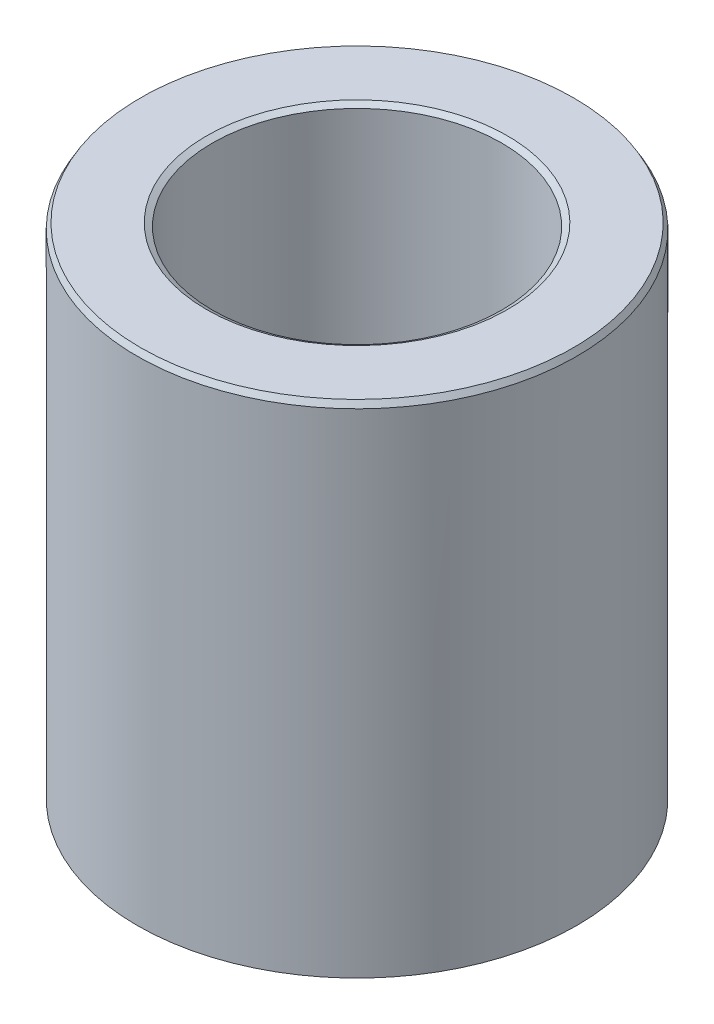
ISO-10303-21;
HEADER;
FILE_DESCRIPTION(('STEP AP214'),'2;1');
FILE_NAME('part.step','',(''),(''),'','','');
FILE_SCHEMA(('AUTOMOTIVE_DESIGN { 1 0 10303 214 1 1 1 1 }'));
ENDSEC;
DATA;
#1=APPLICATION_CONTEXT('core data for automotive mechanical design processes');
#2=APPLICATION_PROTOCOL_DEFINITION('international standard','automotive_design',2000,#1);
#3=PRODUCT_CONTEXT('',#1,'mechanical');
#4=PRODUCT('Part','Part','',(#3));
#5=PRODUCT_RELATED_PRODUCT_CATEGORY('part','',(#4));
#6=PRODUCT_DEFINITION_FORMATION('','',#4);
#7=PRODUCT_DEFINITION_CONTEXT('part definition',#1,'design');
#8=PRODUCT_DEFINITION('design','',#6,#7);
#9=PRODUCT_DEFINITION_SHAPE('','',#8);
#10=(LENGTH_UNIT() NAMED_UNIT(*) SI_UNIT(.MILLI.,.METRE.));
#11=(NAMED_UNIT(*) PLANE_ANGLE_UNIT() SI_UNIT($,.RADIAN.));
#12=(NAMED_UNIT(*) SI_UNIT($,.STERADIAN.) SOLID_ANGLE_UNIT());
#13=UNCERTAINTY_MEASURE_WITH_UNIT(LENGTH_MEASURE(1.E-05),#10,'distance_accuracy_value','');
#14=(GEOMETRIC_REPRESENTATION_CONTEXT(3) GLOBAL_UNCERTAINTY_ASSIGNED_CONTEXT((#13)) GLOBAL_UNIT_ASSIGNED_CONTEXT((#10,
#11,#12)) REPRESENTATION_CONTEXT('',''));
#15=CARTESIAN_POINT('',(0.,0.,0.));
#16=DIRECTION('',(0.,0.,1.));
#17=DIRECTION('',(1.,0.,0.));
#18=AXIS2_PLACEMENT_3D('',#15,#16,#17);
#19=CARTESIAN_POINT('',(0.,102.806656635205,0.));
#20=DIRECTION('',(0.,-1.,0.));
#21=DIRECTION('',(0.,0.,-1.));
#22=AXIS2_PLACEMENT_3D('',#19,#20,#21);
#23=CYLINDRICAL_SURFACE('',#22,45.);
#24=CARTESIAN_POINT('',(0.,0.683298682433511,0.));
#25=DIRECTION('',(0.,1.,0.));
#26=DIRECTION('',(0.,0.,1.));
#27=AXIS2_PLACEMENT_3D('',#24,#25,#26);
#28=CIRCLE('',#27,45.);
#29=CARTESIAN_POINT('',(0.,0.683298682433511,-45.));
#30=VERTEX_POINT('',#29);
#31=EDGE_CURVE('E10',#30,#30,#28,.T.);
#32=CARTESIAN_POINT('',(0.,101.623148600485,0.));
#33=DIRECTION('',(0.,1.,0.));
#34=DIRECTION('',(0.,0.,1.));
#35=AXIS2_PLACEMENT_3D('',#32,#33,#34);
#36=CIRCLE('',#35,45.);
#37=CARTESIAN_POINT('',(0.,101.623148600485,-45.));
#38=VERTEX_POINT('',#37);
#39=EDGE_CURVE('E50',#38,#38,#36,.F.);
#40=CARTESIAN_POINT('',(0.,0.683298682433511,-45.));
#41=CARTESIAN_POINT('',(0.,1.73475545241322,-45.));
#42=CARTESIAN_POINT('',(0.,2.78621222239292,-45.));
#43=CARTESIAN_POINT('',(0.,4.88912576235234,-45.));
#44=CARTESIAN_POINT('',(0.,5.94058253233204,-45.));
#45=CARTESIAN_POINT('',(0.,8.04349607229146,-45.));
#46=CARTESIAN_POINT('',(0.,9.09495284227116,-45.));
#47=CARTESIAN_POINT('',(0.,11.1978663822306,-45.));
#48=CARTESIAN_POINT('',(0.,12.2493231522103,-45.));
#49=CARTESIAN_POINT('',(0.,14.3522366921697,-45.));
#50=CARTESIAN_POINT('',(0.,15.4036934621494,-45.));
#51=CARTESIAN_POINT('',(0.,17.5066070021088,-45.));
#52=CARTESIAN_POINT('',(0.,18.5580637720885,-45.));
#53=CARTESIAN_POINT('',(0.,20.6609773120479,-45.));
#54=CARTESIAN_POINT('',(0.,21.7124340820276,-45.));
#55=CARTESIAN_POINT('',(0.,23.815347621987,-45.));
#56=CARTESIAN_POINT('',(0.,24.8668043919667,-45.));
#57=CARTESIAN_POINT('',(0.,26.9697179319262,-45.));
#58=CARTESIAN_POINT('',(0.,28.0211747019059,-45.));
#59=CARTESIAN_POINT('',(0.,30.1240882418653,-45.));
#60=CARTESIAN_POINT('',(0.,31.175545011845,-45.));
#61=CARTESIAN_POINT('',(0.,33.2784585518044,-45.));
#62=CARTESIAN_POINT('',(0.,34.3299153217841,-45.));
#63=CARTESIAN_POINT('',(0.,36.4328288617435,-45.));
#64=CARTESIAN_POINT('',(0.,37.4842856317232,-45.));
#65=CARTESIAN_POINT('',(0.,39.5871991716826,-45.));
#66=CARTESIAN_POINT('',(0.,40.6386559416623,-45.));
#67=CARTESIAN_POINT('',(0.,42.7415694816218,-45.));
#68=CARTESIAN_POINT('',(0.,43.7930262516015,-45.));
#69=CARTESIAN_POINT('',(0.,45.8959397915609,-45.));
#70=CARTESIAN_POINT('',(0.,46.9473965615406,-45.));
#71=CARTESIAN_POINT('',(0.,49.0503101015,-45.));
#72=CARTESIAN_POINT('',(0.,50.1017668714797,-45.));
#73=CARTESIAN_POINT('',(0.,52.2046804114391,-45.));
#74=CARTESIAN_POINT('',(0.,53.2561371814188,-45.));
#75=CARTESIAN_POINT('',(0.,55.3590507213782,-45.));
#76=CARTESIAN_POINT('',(0.,56.4105074913579,-45.));
#77=CARTESIAN_POINT('',(0.,58.5134210313173,-45.));
#78=CARTESIAN_POINT('',(0.,59.564877801297,-45.));
#79=CARTESIAN_POINT('',(0.,61.6677913412565,-45.));
#80=CARTESIAN_POINT('',(0.,62.7192481112362,-45.));
#81=CARTESIAN_POINT('',(0.,64.8221616511956,-45.));
#82=CARTESIAN_POINT('',(0.,65.8736184211753,-45.));
#83=CARTESIAN_POINT('',(0.,67.9765319611347,-45.));
#84=CARTESIAN_POINT('',(0.,69.0279887311144,-45.));
#85=CARTESIAN_POINT('',(0.,71.1309022710738,-45.));
#86=CARTESIAN_POINT('',(0.,72.1823590410535,-45.));
#87=CARTESIAN_POINT('',(0.,74.2852725810129,-45.));
#88=CARTESIAN_POINT('',(0.,75.3367293509926,-45.));
#89=CARTESIAN_POINT('',(0.,77.4396428909521,-45.));
#90=CARTESIAN_POINT('',(0.,78.4910996609318,-45.));
#91=CARTESIAN_POINT('',(0.,80.5940132008912,-45.));
#92=CARTESIAN_POINT('',(0.,81.6454699708709,-45.));
#93=CARTESIAN_POINT('',(0.,83.7483835108303,-45.));
#94=CARTESIAN_POINT('',(0.,84.79984028081,-45.));
#95=CARTESIAN_POINT('',(0.,86.9027538207694,-45.));
#96=CARTESIAN_POINT('',(0.,87.9542105907491,-45.));
#97=CARTESIAN_POINT('',(0.,90.0571241307085,-45.));
#98=CARTESIAN_POINT('',(0.,91.1085809006882,-45.));
#99=CARTESIAN_POINT('',(0.,93.2114944406476,-45.));
#100=CARTESIAN_POINT('',(0.,94.2629512106273,-45.));
#101=CARTESIAN_POINT('',(0.,96.3658647505868,-45.));
#102=CARTESIAN_POINT('',(0.,97.4173215205664,-45.));
#103=CARTESIAN_POINT('',(0.,99.5202350605259,-45.));
#104=CARTESIAN_POINT('',(0.,100.571691830506,-45.));
#105=CARTESIAN_POINT('',(0.,101.623148600485,-45.));
#106=B_SPLINE_CURVE_WITH_KNOTS('',3,(#40,#41,#42,#43,#44,#45,#46,#47,#48,#49,#50,#51,#52,#53,
#54,#55,#56,#57,#58,#59,#60,#61,#62,#63,#64,#65,#66,#67,#68,#69,#70,#71,#72,#73,#74,#75,#76,#77,
#78,#79,#80,#81,#82,#83,#84,#85,#86,#87,#88,#89,#90,#91,#92,#93,#94,#95,#96,#97,#98,#99,#100,
#101,#102,#103,#104,#105),.UNSPECIFIED.,.F.,.F.,(4,2,2,2,2,2,2,2,2,2,2,2,2,2,2,2,2,2,2,2,2,2,2,
2,2,2,2,2,2,2,2,2,4),(0.,3.15437030993912,6.30874061987824,9.46311092981736,12.6174812397565,
15.7718515496956,18.9262218596347,22.0805921695738,25.2349624795129,28.3893327894521,
31.5437030993912,34.6980734093303,37.8524437192694,41.0068140292085,44.1611843391476,
47.3155546490868,50.4699249590259,53.624295268965,56.7786655789041,59.9330358888432,
63.0874061987824,66.2417765087215,69.3961468186606,72.5505171285997,75.7048874385388,
78.8592577484779,82.0136280584171,85.1679983683562,88.3223686782953,91.4767389882344,
94.6311092981735,97.7854796081127,100.939849918052),.UNSPECIFIED.);
#107=EDGE_CURVE('BSEAM39',#30,#38,#106,.T.);
#108=ORIENTED_EDGE('',*,*,#31,.T.);
#109=ORIENTED_EDGE('',*,*,#39,.T.);
#110=ORIENTED_EDGE('',*,*,#107,.T.);
#111=ORIENTED_EDGE('',*,*,#107,.F.);
#112=EDGE_LOOP('',(#108,#110,#109,#111));
#113=FACE_BOUND('',#112,.T.);
#114=ADVANCED_FACE('F39',(#113),#23,.T.);
#115=CARTESIAN_POINT('',(0.,102.806656635205,0.));
#116=DIRECTION('',(0.,1.,0.));
#117=DIRECTION('',(0.,0.,1.));
#118=AXIS2_PLACEMENT_3D('',#115,#116,#117);
#119=PLANE('',#118);
#120=CARTESIAN_POINT('',(0.,102.806656635205,0.));
#121=DIRECTION('',(0.,1.,0.));
#122=DIRECTION('',(0.,0.,1.));
#123=AXIS2_PLACEMENT_3D('',#120,#121,#122);
#124=CIRCLE('',#123,30.8120299298854);
#125=CARTESIAN_POINT('',(0.,102.806656635205,30.8120299298854));
#126=VERTEX_POINT('',#125);
#127=EDGE_CURVE('E58',#126,#126,#124,.F.);
#128=ORIENTED_EDGE('',*,*,#127,.T.);
#129=EDGE_LOOP('',(#128));
#130=FACE_BOUND('',#129,.T.);
#131=CARTESIAN_POINT('',(0.,102.806656635205,0.));
#132=DIRECTION('',(0.,1.,0.));
#133=DIRECTION('',(0.,0.,1.));
#134=AXIS2_PLACEMENT_3D('',#131,#132,#133);
#135=CIRCLE('',#134,44.3167013175666);
#136=CARTESIAN_POINT('',(0.,102.806656635205,-44.3167013175666));
#137=VERTEX_POINT('',#136);
#138=EDGE_CURVE('E61',#137,#137,#135,.T.);
#139=ORIENTED_EDGE('',*,*,#138,.T.);
#140=EDGE_LOOP('',(#139));
#141=FACE_BOUND('',#140,.T.);
#142=ADVANCED_FACE('F88',(#130,#141),#119,.T.);
#143=CARTESIAN_POINT('',(0.,0.,0.));
#144=DIRECTION('',(0.,1.,0.));
#145=DIRECTION('',(0.,0.,1.));
#146=AXIS2_PLACEMENT_3D('',#143,#144,#145);
#147=PLANE('',#146);
#148=CARTESIAN_POINT('',(0.,0.,0.));
#149=DIRECTION('',(0.,1.,0.));
#150=DIRECTION('',(0.,0.,1.));
#151=AXIS2_PLACEMENT_3D('',#148,#149,#150);
#152=CIRCLE('',#151,30.3118205775991);
#153=CARTESIAN_POINT('',(0.,0.,30.3118205775991));
#154=VERTEX_POINT('',#153);
#155=EDGE_CURVE('E51',#154,#154,#152,.T.);
#156=ORIENTED_EDGE('',*,*,#155,.T.);
#157=EDGE_LOOP('',(#156));
#158=FACE_BOUND('',#157,.T.);
#159=CARTESIAN_POINT('',(0.,0.,0.));
#160=DIRECTION('',(0.,1.,0.));
#161=DIRECTION('',(0.,0.,1.));
#162=AXIS2_PLACEMENT_3D('',#159,#160,#161);
#163=CIRCLE('',#162,43.8164919652803);
#164=CARTESIAN_POINT('',(0.,0.,43.8164919652803));
#165=VERTEX_POINT('',#164);
#166=EDGE_CURVE('E54',#165,#165,#163,.F.);
#167=ORIENTED_EDGE('',*,*,#166,.T.);
#168=EDGE_LOOP('',(#167));
#169=FACE_BOUND('',#168,.T.);
#170=ADVANCED_FACE('F83',(#158,#169),#147,.F.);
#171=CARTESIAN_POINT('',(0.,102.806656635205,0.));
#172=DIRECTION('',(0.,-1.,0.));
#173=DIRECTION('',(0.,0.,-1.));
#174=AXIS2_PLACEMENT_3D('',#171,#172,#173);
#175=CYLINDRICAL_SURFACE('',#174,29.6285218951657);
#176=CARTESIAN_POINT('',(0.,102.123357952771,0.));
#177=DIRECTION('',(0.,1.,0.));
#178=DIRECTION('',(0.,0.,1.));
#179=AXIS2_PLACEMENT_3D('',#176,#177,#178);
#180=CIRCLE('',#179,29.6285218951657);
#181=CARTESIAN_POINT('',(0.,102.123357952771,-29.6285218951657));
#182=VERTEX_POINT('',#181);
#183=EDGE_CURVE('E67',#182,#182,#180,.T.);
#184=CARTESIAN_POINT('',(0.,1.18350803471957,0.));
#185=DIRECTION('',(0.,1.,0.));
#186=DIRECTION('',(0.,0.,1.));
#187=AXIS2_PLACEMENT_3D('',#184,#185,#186);
#188=CIRCLE('',#187,29.6285218951657);
#189=CARTESIAN_POINT('',(0.,1.18350803471957,-29.6285218951657));
#190=VERTEX_POINT('',#189);
#191=EDGE_CURVE('E69',#190,#190,#188,.F.);
#192=CARTESIAN_POINT('',(0.,102.123357952771,-29.6285218951657));
#193=CARTESIAN_POINT('',(0.,101.071901182792,-29.6285218951657));
#194=CARTESIAN_POINT('',(0.,100.020444412812,-29.6285218951657));
#195=CARTESIAN_POINT('',(0.,97.9175308728525,-29.6285218951657));
#196=CARTESIAN_POINT('',(0.,96.8660741028728,-29.6285218951657));
#197=CARTESIAN_POINT('',(0.,94.7631605629134,-29.6285218951657));
#198=CARTESIAN_POINT('',(0.,93.7117037929337,-29.6285218951657));
#199=CARTESIAN_POINT('',(0.,91.6087902529743,-29.6285218951657));
#200=CARTESIAN_POINT('',(0.,90.5573334829946,-29.6285218951657));
#201=CARTESIAN_POINT('',(0.,88.4544199430352,-29.6285218951657));
#202=CARTESIAN_POINT('',(0.,87.4029631730555,-29.6285218951657));
#203=CARTESIAN_POINT('',(0.,85.3000496330961,-29.6285218951657));
#204=CARTESIAN_POINT('',(0.,84.2485928631164,-29.6285218951657));
#205=CARTESIAN_POINT('',(0.,82.1456793231569,-29.6285218951657));
#206=CARTESIAN_POINT('',(0.,81.0942225531772,-29.6285218951657));
#207=CARTESIAN_POINT('',(0.,78.9913090132178,-29.6285218951657));
#208=CARTESIAN_POINT('',(0.,77.9398522432381,-29.6285218951657));
#209=CARTESIAN_POINT('',(0.,75.8369387032787,-29.6285218951657));
#210=CARTESIAN_POINT('',(0.,74.785481933299,-29.6285218951657));
#211=CARTESIAN_POINT('',(0.,72.6825683933396,-29.6285218951657));
#212=CARTESIAN_POINT('',(0.,71.6311116233599,-29.6285218951657));
#213=CARTESIAN_POINT('',(0.,69.5281980834005,-29.6285218951657));
#214=CARTESIAN_POINT('',(0.,68.4767413134208,-29.6285218951657));
#215=CARTESIAN_POINT('',(0.,66.3738277734613,-29.6285218951657));
#216=CARTESIAN_POINT('',(0.,65.3223710034816,-29.6285218951657));
#217=CARTESIAN_POINT('',(0.,63.2194574635222,-29.6285218951657));
#218=CARTESIAN_POINT('',(0.,62.1680006935425,-29.6285218951657));
#219=CARTESIAN_POINT('',(0.,60.0650871535831,-29.6285218951657));
#220=CARTESIAN_POINT('',(0.,59.0136303836034,-29.6285218951657));
#221=CARTESIAN_POINT('',(0.,56.910716843644,-29.6285218951657));
#222=CARTESIAN_POINT('',(0.,55.8592600736643,-29.6285218951657));
#223=CARTESIAN_POINT('',(0.,53.7563465337049,-29.6285218951657));
#224=CARTESIAN_POINT('',(0.,52.7048897637252,-29.6285218951657));
#225=CARTESIAN_POINT('',(0.,50.6019762237658,-29.6285218951657));
#226=CARTESIAN_POINT('',(0.,49.5505194537861,-29.6285218951657));
#227=CARTESIAN_POINT('',(0.,47.4476059138266,-29.6285218951657));
#228=CARTESIAN_POINT('',(0.,46.3961491438469,-29.6285218951657));
#229=CARTESIAN_POINT('',(0.,44.2932356038875,-29.6285218951657));
#230=CARTESIAN_POINT('',(0.,43.2417788339078,-29.6285218951657));
#231=CARTESIAN_POINT('',(0.,41.1388652939484,-29.6285218951657));
#232=CARTESIAN_POINT('',(0.,40.0874085239687,-29.6285218951657));
#233=CARTESIAN_POINT('',(0.,37.9844949840093,-29.6285218951657));
#234=CARTESIAN_POINT('',(0.,36.9330382140296,-29.6285218951657));
#235=CARTESIAN_POINT('',(0.,34.8301246740702,-29.6285218951657));
#236=CARTESIAN_POINT('',(0.,33.7786679040905,-29.6285218951657));
#237=CARTESIAN_POINT('',(0.,31.6757543641311,-29.6285218951657));
#238=CARTESIAN_POINT('',(0.,30.6242975941513,-29.6285218951657));
#239=CARTESIAN_POINT('',(0.,28.5213840541919,-29.6285218951657));
#240=CARTESIAN_POINT('',(0.,27.4699272842122,-29.6285218951657));
#241=CARTESIAN_POINT('',(0.,25.3670137442528,-29.6285218951657));
#242=CARTESIAN_POINT('',(0.,24.3155569742731,-29.6285218951657));
#243=CARTESIAN_POINT('',(0.,22.2126434343137,-29.6285218951657));
#244=CARTESIAN_POINT('',(0.,21.161186664334,-29.6285218951657));
#245=CARTESIAN_POINT('',(0.,19.0582731243746,-29.6285218951657));
#246=CARTESIAN_POINT('',(0.,18.0068163543949,-29.6285218951657));
#247=CARTESIAN_POINT('',(0.,15.9039028144355,-29.6285218951657));
#248=CARTESIAN_POINT('',(0.,14.8524460444558,-29.6285218951657));
#249=CARTESIAN_POINT('',(0.,12.7495325044963,-29.6285218951657));
#250=CARTESIAN_POINT('',(0.,11.6980757345166,-29.6285218951657));
#251=CARTESIAN_POINT('',(0.,9.59516219455723,-29.6285218951657));
#252=CARTESIAN_POINT('',(0.,8.54370542457752,-29.6285218951657));
#253=CARTESIAN_POINT('',(0.,6.44079188461811,-29.6285218951657));
#254=CARTESIAN_POINT('',(0.,5.3893351146384,-29.6285218951657));
#255=CARTESIAN_POINT('',(0.,3.28642157467899,-29.6285218951657));
#256=CARTESIAN_POINT('',(0.,2.23496480469928,-29.6285218951657));
#257=CARTESIAN_POINT('',(0.,1.18350803471957,-29.6285218951657));
#258=B_SPLINE_CURVE_WITH_KNOTS('',3,(#192,#193,#194,#195,#196,#197,#198,#199,#200,#201,#202,
#203,#204,#205,#206,#207,#208,#209,#210,#211,#212,#213,#214,#215,#216,#217,#218,#219,#220,#221,
#222,#223,#224,#225,#226,#227,#228,#229,#230,#231,#232,#233,#234,#235,#236,#237,#238,#239,#240,
#241,#242,#243,#244,#245,#246,#247,#248,#249,#250,#251,#252,#253,#254,#255,#256,#257),
.UNSPECIFIED.,.F.,.F.,(4,2,2,2,2,2,2,2,2,2,2,2,2,2,2,2,2,2,2,2,2,2,2,2,2,2,2,2,2,2,2,2,4),(0.,
3.15437030993911,6.30874061987823,9.46311092981735,12.6174812397565,15.7718515496956,
18.9262218596347,22.0805921695738,25.2349624795129,28.3893327894521,31.5437030993912,
34.6980734093303,37.8524437192694,41.0068140292085,44.1611843391476,47.3155546490868,
50.4699249590259,53.624295268965,56.7786655789041,59.9330358888432,63.0874061987824,
66.2417765087215,69.3961468186606,72.5505171285997,75.7048874385388,78.8592577484779,
82.0136280584171,85.1679983683562,88.3223686782953,91.4767389882344,94.6311092981735,
97.7854796081127,100.939849918052),.UNSPECIFIED.);
#259=EDGE_CURVE('BSEAM71',#182,#190,#258,.T.);
#260=ORIENTED_EDGE('',*,*,#183,.T.);
#261=ORIENTED_EDGE('',*,*,#191,.T.);
#262=ORIENTED_EDGE('',*,*,#259,.T.);
#263=ORIENTED_EDGE('',*,*,#259,.F.);
#264=EDGE_LOOP('',(#260,#262,#261,#263));
#265=FACE_BOUND('',#264,.T.);
#266=ADVANCED_FACE('F71',(#265),#175,.F.);
#267=CARTESIAN_POINT('',(0.,102.123357952771,0.));
#268=DIRECTION('',(0.,1.,0.));
#269=DIRECTION('',(0.,0.,1.));
#270=AXIS2_PLACEMENT_3D('',#267,#268,#269);
#271=CONICAL_SURFACE('',#270,29.6285218951657,1.0471975511966);
#272=ORIENTED_EDGE('',*,*,#127,.F.);
#273=EDGE_LOOP('',(#272));
#274=FACE_BOUND('',#273,.T.);
#275=ORIENTED_EDGE('',*,*,#183,.F.);
#276=EDGE_LOOP('',(#275));
#277=FACE_BOUND('',#276,.T.);
#278=ADVANCED_FACE('F77',(#274,#277),#271,.F.);
#279=CARTESIAN_POINT('',(0.,0.,0.));
#280=DIRECTION('',(0.,-1.,0.));
#281=DIRECTION('',(0.,0.,-1.));
#282=AXIS2_PLACEMENT_3D('',#279,#280,#281);
#283=CONICAL_SURFACE('',#282,30.3118205775991,0.523598775598297);
#284=ORIENTED_EDGE('',*,*,#191,.F.);
#285=EDGE_LOOP('',(#284));
#286=FACE_BOUND('',#285,.T.);
#287=ORIENTED_EDGE('',*,*,#155,.F.);
#288=EDGE_LOOP('',(#287));
#289=FACE_BOUND('',#288,.T.);
#290=ADVANCED_FACE('F73',(#286,#289),#283,.F.);
#291=CARTESIAN_POINT('',(0.,0.683298682433511,0.));
#292=DIRECTION('',(0.,1.,0.));
#293=DIRECTION('',(0.,0.,1.));
#294=AXIS2_PLACEMENT_3D('',#291,#292,#293);
#295=CONICAL_SURFACE('',#294,45.,1.0471975511966);
#296=ORIENTED_EDGE('',*,*,#166,.F.);
#297=EDGE_LOOP('',(#296));
#298=FACE_BOUND('',#297,.T.);
#299=ORIENTED_EDGE('',*,*,#31,.F.);
#300=EDGE_LOOP('',(#299));
#301=FACE_BOUND('',#300,.T.);
#302=ADVANCED_FACE('F76',(#298,#301),#295,.T.);
#303=CARTESIAN_POINT('',(0.,102.806656635205,0.));
#304=DIRECTION('',(0.,-1.,0.));
#305=DIRECTION('',(0.,0.,-1.));
#306=AXIS2_PLACEMENT_3D('',#303,#304,#305);
#307=CONICAL_SURFACE('',#306,44.3167013175666,0.523598775598284);
#308=CARTESIAN_POINT('',(0.,101.623148600485,-45.));
#309=CARTESIAN_POINT('',(0.,101.63547680918,-44.9928823053913));
#310=CARTESIAN_POINT('',(0.,101.647805017875,-44.9857646107827));
#311=CARTESIAN_POINT('',(0.,101.672461435265,-44.9715292215653));
#312=CARTESIAN_POINT('',(0.,101.68478964396,-44.9644115269566));
#313=CARTESIAN_POINT('',(0.,101.70944606135,-44.9501761377392));
#314=CARTESIAN_POINT('',(0.,101.721774270045,-44.9430584431306));
#315=CARTESIAN_POINT('',(0.,101.746430687435,-44.9288230539132));
#316=CARTESIAN_POINT('',(0.,101.75875889613,-44.9217053593045));
#317=CARTESIAN_POINT('',(0.,101.78341531352,-44.9074699700871));
#318=CARTESIAN_POINT('',(0.,101.795743522215,-44.9003522754785));
#319=CARTESIAN_POINT('',(0.,101.820399939605,-44.8861168862611));
#320=CARTESIAN_POINT('',(0.,101.8327281483,-44.8789991916524));
#321=CARTESIAN_POINT('',(0.,101.85738456569,-44.8647638024351));
#322=CARTESIAN_POINT('',(0.,101.869712774385,-44.8576461078264));
#323=CARTESIAN_POINT('',(0.,101.894369191775,-44.843410718609));
#324=CARTESIAN_POINT('',(0.,101.90669740047,-44.8362930240003));
#325=CARTESIAN_POINT('',(0.,101.93135381786,-44.822057634783));
#326=CARTESIAN_POINT('',(0.,101.943682026555,-44.8149399401743));
#327=CARTESIAN_POINT('',(0.,101.968338443945,-44.8007045509569));
#328=CARTESIAN_POINT('',(0.,101.98066665264,-44.7935868563482));
#329=CARTESIAN_POINT('',(0.,102.00532307003,-44.7793514671309));
#330=CARTESIAN_POINT('',(0.,102.017651278725,-44.7722337725222));
#331=CARTESIAN_POINT('',(0.,102.042307696115,-44.7579983833049));
#332=CARTESIAN_POINT('',(0.,102.05463590481,-44.7508806886962));
#333=CARTESIAN_POINT('',(0.,102.0792923222,-44.7366452994788));
#334=CARTESIAN_POINT('',(0.,102.091620530895,-44.7295276048701));
#335=CARTESIAN_POINT('',(0.,102.116276948285,-44.7152922156528));
#336=CARTESIAN_POINT('',(0.,102.12860515698,-44.7081745210441));
#337=CARTESIAN_POINT('',(0.,102.15326157437,-44.6939391318267));
#338=CARTESIAN_POINT('',(0.,102.165589783065,-44.686821437218));
#339=CARTESIAN_POINT('',(0.,102.190246200455,-44.6725860480007));
#340=CARTESIAN_POINT('',(0.,102.20257440915,-44.665468353392));
#341=CARTESIAN_POINT('',(0.,102.22723082654,-44.6512329641746));
#342=CARTESIAN_POINT('',(0.,102.239559035235,-44.644115269566));
#343=CARTESIAN_POINT('',(0.,102.264215452625,-44.6298798803486));
#344=CARTESIAN_POINT('',(0.,102.27654366132,-44.6227621857399));
#345=CARTESIAN_POINT('',(0.,102.30120007871,-44.6085267965225));
#346=CARTESIAN_POINT('',(0.,102.313528287405,-44.6014091019139));
#347=CARTESIAN_POINT('',(0.,102.338184704795,-44.5871737126965));
#348=CARTESIAN_POINT('',(0.,102.35051291349,-44.5800560180878));
#349=CARTESIAN_POINT('',(0.,102.37516933088,-44.5658206288704));
#350=CARTESIAN_POINT('',(0.,102.387497539575,-44.5587029342618));
#351=CARTESIAN_POINT('',(0.,102.412153956965,-44.5444675450444));
#352=CARTESIAN_POINT('',(0.,102.42448216566,-44.5373498504357));
#353=CARTESIAN_POINT('',(0.,102.44913858305,-44.5231144612184));
#354=CARTESIAN_POINT('',(0.,102.461466791745,-44.5159967666097));
#355=CARTESIAN_POINT('',(0.,102.486123209135,-44.5017613773923));
#356=CARTESIAN_POINT('',(0.,102.49845141783,-44.4946436827836));
#357=CARTESIAN_POINT('',(0.,102.52310783522,-44.4804082935663));
#358=CARTESIAN_POINT('',(0.,102.535436043915,-44.4732905989576));
#359=CARTESIAN_POINT('',(0.,102.560092461305,-44.4590552097402));
#360=CARTESIAN_POINT('',(0.,102.57242067,-44.4519375151315));
#361=CARTESIAN_POINT('',(0.,102.59707708739,-44.4377021259142));
#362=CARTESIAN_POINT('',(0.,102.609405296085,-44.4305844313055));
#363=CARTESIAN_POINT('',(0.,102.634061713475,-44.4163490420882));
#364=CARTESIAN_POINT('',(0.,102.64638992217,-44.4092313474795));
#365=CARTESIAN_POINT('',(0.,102.67104633956,-44.3949959582621));
#366=CARTESIAN_POINT('',(0.,102.683374548255,-44.3878782636534));
#367=CARTESIAN_POINT('',(0.,102.708030965645,-44.3736428744361));
#368=CARTESIAN_POINT('',(0.,102.72035917434,-44.3665251798274));
#369=CARTESIAN_POINT('',(0.,102.74501559173,-44.35228979061));
#370=CARTESIAN_POINT('',(0.,102.757343800425,-44.3451720960013));
#371=CARTESIAN_POINT('',(0.,102.782000217815,-44.330936706784));
#372=CARTESIAN_POINT('',(0.,102.79432842651,-44.3238190121753));
#373=CARTESIAN_POINT('',(0.,102.806656635205,-44.3167013175666));
#374=B_SPLINE_CURVE_WITH_KNOTS('',3,(#308,#309,#310,#311,#312,#313,#314,#315,#316,#317,#318,
#319,#320,#321,#322,#323,#324,#325,#326,#327,#328,#329,#330,#331,#332,#333,#334,#335,#336,#337,
#338,#339,#340,#341,#342,#343,#344,#345,#346,#347,#348,#349,#350,#351,#352,#353,#354,#355,#356,
#357,#358,#359,#360,#361,#362,#363,#364,#365,#366,#367,#368,#369,#370,#371,#372,#373),
.UNSPECIFIED.,.F.,.F.,(4,2,2,2,2,2,2,2,2,2,2,2,2,2,2,2,2,2,2,2,2,2,2,2,2,2,2,2,2,2,2,2,4),(0.,
0.0427061676520952,0.0854123353041785,0.128118502956274,0.170824670608357,0.213530838260449,
0.256237005912532,0.298943173564627,0.34164934121671,0.384355508868806,0.427061676520889,
0.469767844172981,0.512474011825064,0.555180179477159,0.597886347129242,0.640592514781338,
0.683298682433417,0.726004850085513,0.768711017737596,0.811417185389691,0.854123353041774,
0.896829520693866,0.939535688345949,0.982241855998044,1.02494802365013,1.06765419130222,
1.11036035895431,1.1530665266064,1.19577269425849,1.23847886191058,1.28118502956267,
1.32389119721475,1.36659736486685),.UNSPECIFIED.);
#375=EDGE_CURVE('BSEAM45',#38,#137,#374,.T.);
#376=ORIENTED_EDGE('',*,*,#39,.F.);
#377=ORIENTED_EDGE('',*,*,#138,.F.);
#378=ORIENTED_EDGE('',*,*,#375,.T.);
#379=ORIENTED_EDGE('',*,*,#375,.F.);
#380=EDGE_LOOP('',(#376,#378,#377,#379));
#381=FACE_BOUND('',#380,.T.);
#382=ADVANCED_FACE('F45',(#381),#307,.T.);
#383=CLOSED_SHELL('',(#114,#142,#170,#266,#278,#290,#302,#382));
#384=MANIFOLD_SOLID_BREP('B2',#383);
#385=ADVANCED_BREP_SHAPE_REPRESENTATION('',(#18,#384),#14);
#386=SHAPE_DEFINITION_REPRESENTATION(#9,#385);
ENDSEC;
END-ISO-10303-21;
